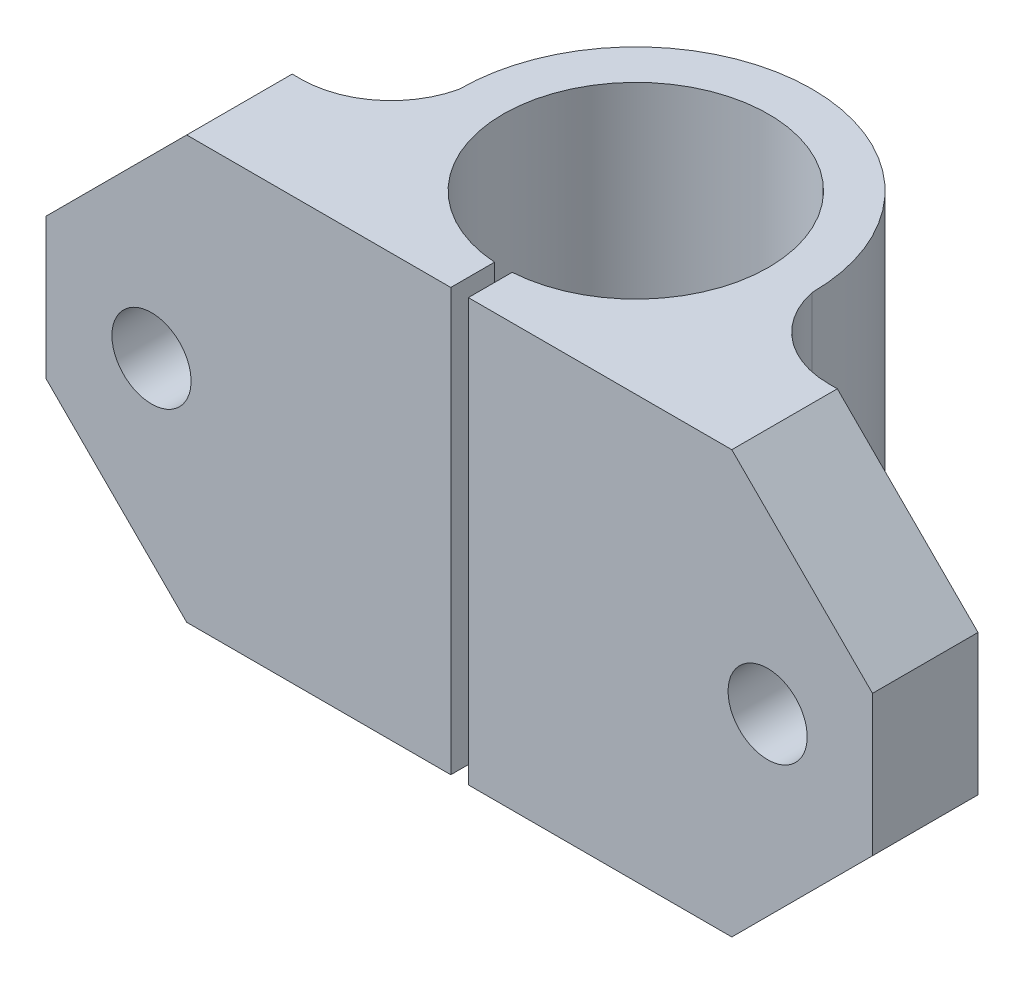
ISO-10303-21;
HEADER;
FILE_DESCRIPTION(('STEP AP214'),'2;1');
FILE_NAME('part.step','',(''),(''),'','','');
FILE_SCHEMA(('AUTOMOTIVE_DESIGN { 1 0 10303 214 1 1 1 1 }'));
ENDSEC;
DATA;
#1=APPLICATION_CONTEXT('core data for automotive mechanical design processes');
#2=APPLICATION_PROTOCOL_DEFINITION('international standard','automotive_design',2000,#1);
#3=PRODUCT_CONTEXT('',#1,'mechanical');
#4=PRODUCT('Part','Part','',(#3));
#5=PRODUCT_RELATED_PRODUCT_CATEGORY('part','',(#4));
#6=PRODUCT_DEFINITION_FORMATION('','',#4);
#7=PRODUCT_DEFINITION_CONTEXT('part definition',#1,'design');
#8=PRODUCT_DEFINITION('design','',#6,#7);
#9=PRODUCT_DEFINITION_SHAPE('','',#8);
#10=(LENGTH_UNIT() NAMED_UNIT(*) SI_UNIT(.MILLI.,.METRE.));
#11=(NAMED_UNIT(*) PLANE_ANGLE_UNIT() SI_UNIT($,.RADIAN.));
#12=(NAMED_UNIT(*) SI_UNIT($,.STERADIAN.) SOLID_ANGLE_UNIT());
#13=UNCERTAINTY_MEASURE_WITH_UNIT(LENGTH_MEASURE(1.E-05),#10,'distance_accuracy_value','');
#14=(GEOMETRIC_REPRESENTATION_CONTEXT(3) GLOBAL_UNCERTAINTY_ASSIGNED_CONTEXT((#13)) GLOBAL_UNIT_ASSIGNED_CONTEXT((#10,
#11,#12)) REPRESENTATION_CONTEXT('',''));
#15=CARTESIAN_POINT('',(0.,0.,0.));
#16=DIRECTION('',(0.,0.,1.));
#17=DIRECTION('',(1.,0.,0.));
#18=AXIS2_PLACEMENT_3D('',#15,#16,#17);
#19=CARTESIAN_POINT('',(0.,0.,0.));
#20=DIRECTION('',(0.,0.,1.));
#21=DIRECTION('',(1.,0.,0.));
#22=AXIS2_PLACEMENT_3D('',#19,#20,#21);
#23=PLANE('',#22);
#24=CARTESIAN_POINT('',(41.0372666212457,12.,0.));
#25=DIRECTION('',(0.,0.,-1.));
#26=DIRECTION('',(-1.,0.,0.));
#27=AXIS2_PLACEMENT_3D('',#24,#25,#26);
#28=CIRCLE('',#27,2.25000000000006);
#29=CARTESIAN_POINT('',(38.7872666212456,12.,0.));
#30=VERTEX_POINT('',#29);
#31=EDGE_CURVE('E348',#30,#30,#28,.T.);
#32=ORIENTED_EDGE('',*,*,#31,.T.);
#33=EDGE_LOOP('',(#32));
#34=FACE_BOUND('',#33,.T.);
#35=DIRECTION('',(1.,0.,0.));
#36=VECTOR('',#35,1.);
#37=CARTESIAN_POINT('',(0.,0.,0.));
#38=LINE('',#37,#36);
#39=CARTESIAN_POINT('',(24.0186333106229,0.,0.));
#40=VERTEX_POINT('',#39);
#41=CARTESIAN_POINT('',(38.9999999999999,0.,0.));
#42=VERTEX_POINT('',#41);
#43=EDGE_CURVE('E192',#40,#42,#38,.T.);
#44=ORIENTED_EDGE('',*,*,#43,.T.);
#45=DIRECTION('',(-0.707106781186549,-0.707106781186546,0.));
#46=VECTOR('',#45,1.);
#47=CARTESIAN_POINT('',(19.4999999999999,-19.5,0.));
#48=LINE('',#47,#46);
#49=CARTESIAN_POINT('',(47.,8.,0.));
#50=VERTEX_POINT('',#49);
#51=EDGE_CURVE('E267',#42,#50,#48,.F.);
#52=ORIENTED_EDGE('',*,*,#51,.T.);
#53=DIRECTION('',(0.,1.,0.));
#54=VECTOR('',#53,1.);
#55=CARTESIAN_POINT('',(47.,0.,0.));
#56=LINE('',#55,#54);
#57=CARTESIAN_POINT('',(47.,16.,0.));
#58=VERTEX_POINT('',#57);
#59=EDGE_CURVE('E238',#50,#58,#56,.T.);
#60=ORIENTED_EDGE('',*,*,#59,.T.);
#61=DIRECTION('',(-0.707106781186546,0.707106781186549,0.));
#62=VECTOR('',#61,1.);
#63=CARTESIAN_POINT('',(31.5000000000001,31.4999999999999,0.));
#64=LINE('',#63,#62);
#65=CARTESIAN_POINT('',(39.,24.,0.));
#66=VERTEX_POINT('',#65);
#67=EDGE_CURVE('E49',#58,#66,#64,.T.);
#68=ORIENTED_EDGE('',*,*,#67,.T.);
#69=DIRECTION('',(1.,0.,0.));
#70=VECTOR('',#69,1.);
#71=CARTESIAN_POINT('',(0.,24.,0.));
#72=LINE('',#71,#70);
#73=CARTESIAN_POINT('',(24.0186333106229,24.,0.));
#74=VERTEX_POINT('',#73);
#75=EDGE_CURVE('E159',#74,#66,#72,.T.);
#76=ORIENTED_EDGE('',*,*,#75,.F.);
#77=DIRECTION('',(0.,-1.,0.));
#78=VECTOR('',#77,1.);
#79=CARTESIAN_POINT('',(24.0186333106229,24.,0.));
#80=LINE('',#79,#78);
#81=EDGE_CURVE('E174',#74,#40,#80,.T.);
#82=ORIENTED_EDGE('',*,*,#81,.T.);
#83=EDGE_LOOP('',(#44,#52,#60,#68,#76,#82));
#84=FACE_BOUND('',#83,.T.);
#85=ADVANCED_FACE('F34',(#34,#84),#23,.T.);
#86=CARTESIAN_POINT('',(0.,0.,-6.));
#87=DIRECTION('',(-1.,0.,0.));
#88=DIRECTION('',(0.,0.,1.));
#89=AXIS2_PLACEMENT_3D('',#86,#87,#88);
#90=PLANE('',#89);
#91=DIRECTION('',(0.,1.,0.));
#92=VECTOR('',#91,1.);
#93=CARTESIAN_POINT('',(0.,0.,-6.));
#94=LINE('',#93,#92);
#95=CARTESIAN_POINT('',(0.,8.,-6.));
#96=VERTEX_POINT('',#95);
#97=CARTESIAN_POINT('',(0.,16.,-6.));
#98=VERTEX_POINT('',#97);
#99=EDGE_CURVE('E222',#96,#98,#94,.T.);
#100=ORIENTED_EDGE('',*,*,#99,.F.);
#101=DIRECTION('',(0.,0.,1.));
#102=VECTOR('',#101,1.);
#103=CARTESIAN_POINT('',(0.,8.,-6.));
#104=LINE('',#103,#102);
#105=CARTESIAN_POINT('',(0.,8.,0.));
#106=VERTEX_POINT('',#105);
#107=EDGE_CURVE('E243',#96,#106,#104,.T.);
#108=ORIENTED_EDGE('',*,*,#107,.T.);
#109=DIRECTION('',(0.,1.,0.));
#110=VECTOR('',#109,1.);
#111=CARTESIAN_POINT('',(0.,0.,0.));
#112=LINE('',#111,#110);
#113=CARTESIAN_POINT('',(0.,16.,0.));
#114=VERTEX_POINT('',#113);
#115=EDGE_CURVE('E206',#106,#114,#112,.T.);
#116=ORIENTED_EDGE('',*,*,#115,.T.);
#117=DIRECTION('',(0.,0.,-1.));
#118=VECTOR('',#117,1.);
#119=CARTESIAN_POINT('',(0.,16.,-6.));
#120=LINE('',#119,#118);
#121=EDGE_CURVE('E225',#114,#98,#120,.T.);
#122=ORIENTED_EDGE('',*,*,#121,.T.);
#123=EDGE_LOOP('',(#100,#108,#116,#122));
#124=FACE_BOUND('',#123,.T.);
#125=ADVANCED_FACE('F303',(#124),#90,.T.);
#126=CARTESIAN_POINT('',(8.50000000000001,0.,-6.));
#127=DIRECTION('',(0.,0.,-1.));
#128=DIRECTION('',(-1.,0.,0.));
#129=AXIS2_PLACEMENT_3D('',#126,#127,#128);
#130=PLANE('',#129);
#131=CARTESIAN_POINT('',(6.,12.,-6.00000000000001));
#132=DIRECTION('',(0.,0.,-1.));
#133=DIRECTION('',(-1.,0.,0.));
#134=AXIS2_PLACEMENT_3D('',#131,#132,#133);
#135=CIRCLE('',#134,2.25000000000007);
#136=CARTESIAN_POINT('',(3.74999999999994,12.,-6.00000000000001));
#137=VERTEX_POINT('',#136);
#138=EDGE_CURVE('E345',#137,#137,#135,.T.);
#139=ORIENTED_EDGE('',*,*,#138,.F.);
#140=EDGE_LOOP('',(#139));
#141=FACE_BOUND('',#140,.T.);
#142=DIRECTION('',(-1.,0.,0.));
#143=VECTOR('',#142,1.);
#144=CARTESIAN_POINT('',(8.50000000000001,0.,-6.));
#145=LINE('',#144,#143);
#146=CARTESIAN_POINT('',(8.50000000000001,0.,-6.00000000000002));
#147=VERTEX_POINT('',#146);
#148=CARTESIAN_POINT('',(8.00000000000003,0.,-6.));
#149=VERTEX_POINT('',#148);
#150=EDGE_CURVE('E203',#147,#149,#145,.T.);
#151=ORIENTED_EDGE('',*,*,#150,.T.);
#152=DIRECTION('',(0.707106781186549,-0.707106781186546,0.));
#153=VECTOR('',#152,1.);
#154=CARTESIAN_POINT('',(8.25000000000002,-0.249999999999996,-6.));
#155=LINE('',#154,#153);
#156=EDGE_CURVE('E256',#149,#96,#155,.F.);
#157=ORIENTED_EDGE('',*,*,#156,.T.);
#158=ORIENTED_EDGE('',*,*,#99,.T.);
#159=DIRECTION('',(0.707106781186546,0.707106781186549,0.));
#160=VECTOR('',#159,1.);
#161=CARTESIAN_POINT('',(-3.75,12.25,-6.));
#162=LINE('',#161,#160);
#163=CARTESIAN_POINT('',(8.,24.,-6.));
#164=VERTEX_POINT('',#163);
#165=EDGE_CURVE('E254',#98,#164,#162,.T.);
#166=ORIENTED_EDGE('',*,*,#165,.T.);
#167=DIRECTION('',(-1.,0.,0.));
#168=VECTOR('',#167,1.);
#169=CARTESIAN_POINT('',(8.50000000000001,24.,-6.));
#170=LINE('',#169,#168);
#171=CARTESIAN_POINT('',(8.50000000000001,24.,-6.00000000000002));
#172=VERTEX_POINT('',#171);
#173=EDGE_CURVE('E220',#172,#164,#170,.T.);
#174=ORIENTED_EDGE('',*,*,#173,.F.);
#175=DIRECTION('',(0.,1.,0.));
#176=VECTOR('',#175,1.);
#177=CARTESIAN_POINT('',(8.50000000000001,0.,-6.00000000000002));
#178=LINE('',#177,#176);
#179=EDGE_CURVE('E226',#147,#172,#178,.T.);
#180=ORIENTED_EDGE('',*,*,#179,.F.);
#181=EDGE_LOOP('',(#151,#157,#158,#166,#174,#180));
#182=FACE_BOUND('',#181,.T.);
#183=ADVANCED_FACE('F289',(#141,#182),#130,.T.);
#184=CARTESIAN_POINT('',(8.50000000000001,0.,-11.1210427356607));
#185=DIRECTION('',(0.,1.,0.));
#186=DIRECTION('',(0.,0.,1.));
#187=AXIS2_PLACEMENT_3D('',#184,#185,#186);
#188=CYLINDRICAL_SURFACE('',#187,5.12104273566066);
#189=CARTESIAN_POINT('',(8.50000000000001,24.,-11.1210427356607));
#190=DIRECTION('',(0.,-1.,0.));
#191=DIRECTION('',(0.,0.,-1.));
#192=AXIS2_PLACEMENT_3D('',#189,#190,#191);
#193=CIRCLE('',#192,5.12104273566066);
#194=CARTESIAN_POINT('',(13.4959473897421,24.,-9.99605901160399));
#195=VERTEX_POINT('',#194);
#196=EDGE_CURVE('E217',#195,#172,#193,.T.);
#197=ORIENTED_EDGE('',*,*,#196,.F.);
#198=DIRECTION('',(0.,1.,0.));
#199=VECTOR('',#198,1.);
#200=CARTESIAN_POINT('',(13.4959473897421,0.,-9.99605901160399));
#201=LINE('',#200,#199);
#202=CARTESIAN_POINT('',(13.4959473897421,0.,-9.99605901160399));
#203=VERTEX_POINT('',#202);
#204=EDGE_CURVE('E228',#203,#195,#201,.T.);
#205=ORIENTED_EDGE('',*,*,#204,.F.);
#206=CARTESIAN_POINT('',(8.50000000000001,0.,-11.1210427356607));
#207=DIRECTION('',(0.,-1.,0.));
#208=DIRECTION('',(0.,0.,-1.));
#209=AXIS2_PLACEMENT_3D('',#206,#207,#208);
#210=CIRCLE('',#209,5.12104273566066);
#211=EDGE_CURVE('E200',#203,#147,#210,.T.);
#212=ORIENTED_EDGE('',*,*,#211,.T.);
#213=ORIENTED_EDGE('',*,*,#179,.T.);
#214=EDGE_LOOP('',(#197,#205,#212,#213));
#215=FACE_BOUND('',#214,.T.);
#216=ADVANCED_FACE('F286',(#215),#188,.F.);
#217=CARTESIAN_POINT('',(23.5186333106229,0.,-10.0227213844719));
#218=DIRECTION('',(0.,1.,0.));
#219=DIRECTION('',(0.,0.,1.));
#220=AXIS2_PLACEMENT_3D('',#217,#218,#219);
#221=CYLINDRICAL_SURFACE('',#220,10.0227213844719);
#222=CARTESIAN_POINT('',(23.5186333106229,24.,-10.0227213844719));
#223=DIRECTION('',(0.,1.,0.));
#224=DIRECTION('',(0.,0.,1.));
#225=AXIS2_PLACEMENT_3D('',#222,#223,#224);
#226=CIRCLE('',#225,10.0227213844719);
#227=CARTESIAN_POINT('',(33.5413546555968,24.,-10.021831577252));
#228=VERTEX_POINT('',#227);
#229=EDGE_CURVE('E214',#228,#195,#226,.T.);
#230=ORIENTED_EDGE('',*,*,#229,.F.);
#231=DIRECTION('',(0.,1.,0.));
#232=VECTOR('',#231,1.);
#233=CARTESIAN_POINT('',(33.5413546555968,0.,-10.021831577252));
#234=LINE('',#233,#232);
#235=CARTESIAN_POINT('',(33.5413546555968,0.,-10.021831577252));
#236=VERTEX_POINT('',#235);
#237=EDGE_CURVE('E230',#236,#228,#234,.T.);
#238=ORIENTED_EDGE('',*,*,#237,.F.);
#239=CARTESIAN_POINT('',(23.5186333106229,0.,-10.0227213844719));
#240=DIRECTION('',(0.,1.,0.));
#241=DIRECTION('',(0.,0.,1.));
#242=AXIS2_PLACEMENT_3D('',#239,#240,#241);
#243=CIRCLE('',#242,10.0227213844719);
#244=EDGE_CURVE('E197',#236,#203,#243,.T.);
#245=ORIENTED_EDGE('',*,*,#244,.T.);
#246=ORIENTED_EDGE('',*,*,#204,.T.);
#247=EDGE_LOOP('',(#230,#238,#245,#246));
#248=FACE_BOUND('',#247,.T.);
#249=ADVANCED_FACE('F282',(#248),#221,.T.);
#250=CARTESIAN_POINT('',(38.5000000000001,0.,-11.0677523541657));
#251=DIRECTION('',(0.,1.,0.));
#252=DIRECTION('',(0.,0.,1.));
#253=AXIS2_PLACEMENT_3D('',#250,#251,#252);
#254=CYLINDRICAL_SURFACE('',#253,5.06775235416579);
#255=CARTESIAN_POINT('',(38.5000000000001,24.,-11.0677523541657));
#256=DIRECTION('',(0.,-1.,0.));
#257=DIRECTION('',(0.,0.,-1.));
#258=AXIS2_PLACEMENT_3D('',#255,#256,#257);
#259=CIRCLE('',#258,5.06775235416579);
#260=CARTESIAN_POINT('',(38.5,24.,-6.00000000000001));
#261=VERTEX_POINT('',#260);
#262=EDGE_CURVE('E211',#261,#228,#259,.T.);
#263=ORIENTED_EDGE('',*,*,#262,.F.);
#264=DIRECTION('',(0.,1.,0.));
#265=VECTOR('',#264,1.);
#266=CARTESIAN_POINT('',(38.5,0.,-6.00000000000001));
#267=LINE('',#266,#265);
#268=CARTESIAN_POINT('',(38.5,0.,-6.00000000000001));
#269=VERTEX_POINT('',#268);
#270=EDGE_CURVE('E232',#269,#261,#267,.T.);
#271=ORIENTED_EDGE('',*,*,#270,.F.);
#272=CARTESIAN_POINT('',(38.5000000000001,0.,-11.0677523541657));
#273=DIRECTION('',(0.,-1.,0.));
#274=DIRECTION('',(0.,0.,-1.));
#275=AXIS2_PLACEMENT_3D('',#272,#273,#274);
#276=CIRCLE('',#275,5.06775235416579);
#277=EDGE_CURVE('E194',#269,#236,#276,.T.);
#278=ORIENTED_EDGE('',*,*,#277,.T.);
#279=ORIENTED_EDGE('',*,*,#237,.T.);
#280=EDGE_LOOP('',(#263,#271,#278,#279));
#281=FACE_BOUND('',#280,.T.);
#282=ADVANCED_FACE('F277',(#281),#254,.F.);
#283=CARTESIAN_POINT('',(47.,0.,-6.));
#284=DIRECTION('',(0.,0.,-1.));
#285=DIRECTION('',(-1.,0.,0.));
#286=AXIS2_PLACEMENT_3D('',#283,#284,#285);
#287=PLANE('',#286);
#288=CARTESIAN_POINT('',(41.0372666212457,12.,-6.00000000000001));
#289=DIRECTION('',(0.,0.,-1.));
#290=DIRECTION('',(-1.,0.,0.));
#291=AXIS2_PLACEMENT_3D('',#288,#289,#290);
#292=CIRCLE('',#291,2.25000000000006);
#293=CARTESIAN_POINT('',(38.7872666212456,12.,-6.00000000000001));
#294=VERTEX_POINT('',#293);
#295=EDGE_CURVE('E352',#294,#294,#292,.T.);
#296=ORIENTED_EDGE('',*,*,#295,.F.);
#297=EDGE_LOOP('',(#296));
#298=FACE_BOUND('',#297,.T.);
#299=DIRECTION('',(0.,1.,0.));
#300=VECTOR('',#299,1.);
#301=CARTESIAN_POINT('',(47.,0.,-6.));
#302=LINE('',#301,#300);
#303=CARTESIAN_POINT('',(47.,8.,-6.));
#304=VERTEX_POINT('',#303);
#305=CARTESIAN_POINT('',(47.,16.,-6.));
#306=VERTEX_POINT('',#305);
#307=EDGE_CURVE('E235',#304,#306,#302,.T.);
#308=ORIENTED_EDGE('',*,*,#307,.F.);
#309=DIRECTION('',(0.707106781186549,0.707106781186546,0.));
#310=VECTOR('',#309,1.);
#311=CARTESIAN_POINT('',(43.,4.00000000000001,-6.));
#312=LINE('',#311,#310);
#313=CARTESIAN_POINT('',(38.9999999999999,0.,-6.00000000000001));
#314=VERTEX_POINT('',#313);
#315=EDGE_CURVE('E264',#304,#314,#312,.F.);
#316=ORIENTED_EDGE('',*,*,#315,.T.);
#317=DIRECTION('',(-1.,0.,0.));
#318=VECTOR('',#317,1.);
#319=CARTESIAN_POINT('',(47.,0.,-6.));
#320=LINE('',#319,#318);
#321=EDGE_CURVE('E191',#314,#269,#320,.T.);
#322=ORIENTED_EDGE('',*,*,#321,.T.);
#323=ORIENTED_EDGE('',*,*,#270,.T.);
#324=DIRECTION('',(-1.,0.,0.));
#325=VECTOR('',#324,1.);
#326=CARTESIAN_POINT('',(47.,24.,-6.));
#327=LINE('',#326,#325);
#328=CARTESIAN_POINT('',(39.,24.,-6.00000000000001));
#329=VERTEX_POINT('',#328);
#330=EDGE_CURVE('E209',#329,#261,#327,.T.);
#331=ORIENTED_EDGE('',*,*,#330,.F.);
#332=DIRECTION('',(0.707106781186546,-0.707106781186549,0.));
#333=VECTOR('',#332,1.);
#334=CARTESIAN_POINT('',(55.,7.99999999999996,-6.));
#335=LINE('',#334,#333);
#336=EDGE_CURVE('E57',#329,#306,#335,.T.);
#337=ORIENTED_EDGE('',*,*,#336,.T.);
#338=EDGE_LOOP('',(#308,#316,#322,#323,#331,#337));
#339=FACE_BOUND('',#338,.T.);
#340=ADVANCED_FACE('F271',(#298,#339),#287,.T.);
#341=CARTESIAN_POINT('',(47.,0.,0.));
#342=DIRECTION('',(1.,0.,0.));
#343=DIRECTION('',(0.,0.,-1.));
#344=AXIS2_PLACEMENT_3D('',#341,#342,#343);
#345=PLANE('',#344);
#346=ORIENTED_EDGE('',*,*,#59,.F.);
#347=DIRECTION('',(0.,0.,-1.));
#348=VECTOR('',#347,1.);
#349=CARTESIAN_POINT('',(47.,8.,0.));
#350=LINE('',#349,#348);
#351=EDGE_CURVE('E260',#50,#304,#350,.T.);
#352=ORIENTED_EDGE('',*,*,#351,.T.);
#353=ORIENTED_EDGE('',*,*,#307,.T.);
#354=DIRECTION('',(0.,0.,1.));
#355=VECTOR('',#354,1.);
#356=CARTESIAN_POINT('',(47.,16.,0.));
#357=LINE('',#356,#355);
#358=EDGE_CURVE('E258',#306,#58,#357,.T.);
#359=ORIENTED_EDGE('',*,*,#358,.T.);
#360=EDGE_LOOP('',(#346,#352,#353,#359));
#361=FACE_BOUND('',#360,.T.);
#362=ADVANCED_FACE('F334',(#361),#345,.T.);
#363=CARTESIAN_POINT('',(6.,12.,0.));
#364=DIRECTION('',(0.,0.,-1.));
#365=DIRECTION('',(-1.,0.,0.));
#366=AXIS2_PLACEMENT_3D('',#363,#364,#365);
#367=CIRCLE('',#366,2.25000000000007);
#368=CARTESIAN_POINT('',(3.74999999999994,12.,0.));
#369=VERTEX_POINT('',#368);
#370=EDGE_CURVE('E170',#369,#369,#367,.T.);
#371=ORIENTED_EDGE('',*,*,#370,.T.);
#372=EDGE_LOOP('',(#371));
#373=FACE_BOUND('',#372,.T.);
#374=ORIENTED_EDGE('',*,*,#115,.F.);
#375=DIRECTION('',(-0.707106781186549,0.707106781186546,0.));
#376=VECTOR('',#375,1.);
#377=CARTESIAN_POINT('',(4.,4.00000000000001,0.));
#378=LINE('',#377,#376);
#379=CARTESIAN_POINT('',(8.00000000000002,0.,0.));
#380=VERTEX_POINT('',#379);
#381=EDGE_CURVE('E248',#106,#380,#378,.F.);
#382=ORIENTED_EDGE('',*,*,#381,.T.);
#383=CARTESIAN_POINT('',(23.0186333106229,0.,0.));
#384=VERTEX_POINT('',#383);
#385=EDGE_CURVE('E189',#380,#384,#38,.T.);
#386=ORIENTED_EDGE('',*,*,#385,.T.);
#387=DIRECTION('',(0.,-1.,0.));
#388=VECTOR('',#387,1.);
#389=CARTESIAN_POINT('',(23.0186333106229,24.,0.));
#390=LINE('',#389,#388);
#391=CARTESIAN_POINT('',(23.0186333106229,24.,0.));
#392=VERTEX_POINT('',#391);
#393=EDGE_CURVE('E185',#392,#384,#390,.T.);
#394=ORIENTED_EDGE('',*,*,#393,.F.);
#395=CARTESIAN_POINT('',(8.,24.,0.));
#396=VERTEX_POINT('',#395);
#397=EDGE_CURVE('E207',#396,#392,#72,.T.);
#398=ORIENTED_EDGE('',*,*,#397,.F.);
#399=DIRECTION('',(-0.707106781186546,-0.707106781186549,0.));
#400=VECTOR('',#399,1.);
#401=CARTESIAN_POINT('',(-7.99999999999999,7.99999999999996,0.));
#402=LINE('',#401,#400);
#403=EDGE_CURVE('E246',#396,#114,#402,.T.);
#404=ORIENTED_EDGE('',*,*,#403,.T.);
#405=EDGE_LOOP('',(#374,#382,#386,#394,#398,#404));
#406=FACE_BOUND('',#405,.T.);
#407=ADVANCED_FACE('F299',(#373,#406),#23,.T.);
#408=CARTESIAN_POINT('',(38.5000000000001,0.,-11.0677523541657));
#409=DIRECTION('',(0.,-1.,0.));
#410=DIRECTION('',(0.,0.,-1.));
#411=AXIS2_PLACEMENT_3D('',#408,#409,#410);
#412=PLANE('',#411);
#413=ORIENTED_EDGE('',*,*,#385,.F.);
#414=DIRECTION('',(0.,0.,-1.));
#415=VECTOR('',#414,1.);
#416=CARTESIAN_POINT('',(8.00000000000003,0.,-11.0677523541657));
#417=LINE('',#416,#415);
#418=EDGE_CURVE('E252',#380,#149,#417,.T.);
#419=ORIENTED_EDGE('',*,*,#418,.T.);
#420=ORIENTED_EDGE('',*,*,#150,.F.);
#421=ORIENTED_EDGE('',*,*,#211,.F.);
#422=ORIENTED_EDGE('',*,*,#244,.F.);
#423=ORIENTED_EDGE('',*,*,#277,.F.);
#424=ORIENTED_EDGE('',*,*,#321,.F.);
#425=DIRECTION('',(0.,0.,1.));
#426=VECTOR('',#425,1.);
#427=CARTESIAN_POINT('',(38.9999999999999,0.,-11.0677523541657));
#428=LINE('',#427,#426);
#429=EDGE_CURVE('E250',#314,#42,#428,.T.);
#430=ORIENTED_EDGE('',*,*,#429,.T.);
#431=ORIENTED_EDGE('',*,*,#43,.F.);
#432=DIRECTION('',(0.,0.,1.));
#433=VECTOR('',#432,1.);
#434=CARTESIAN_POINT('',(24.0186333106229,0.,-2.48929586881175));
#435=LINE('',#434,#433);
#436=CARTESIAN_POINT('',(24.0186333106229,0.,-2.48929586881175));
#437=VERTEX_POINT('',#436);
#438=EDGE_CURVE('E179',#437,#40,#435,.T.);
#439=ORIENTED_EDGE('',*,*,#438,.F.);
#440=CARTESIAN_POINT('',(23.5186333106229,0.,-10.022721384472));
#441=DIRECTION('',(0.,1.,0.));
#442=DIRECTION('',(0.,0.,1.));
#443=AXIS2_PLACEMENT_3D('',#440,#441,#442);
#444=CIRCLE('',#443,7.55000000000005);
#445=CARTESIAN_POINT('',(23.0186333106229,0.,-2.48929586881175));
#446=VERTEX_POINT('',#445);
#447=EDGE_CURVE('E155',#437,#446,#444,.T.);
#448=ORIENTED_EDGE('',*,*,#447,.T.);
#449=DIRECTION('',(0.,0.,-1.));
#450=VECTOR('',#449,1.);
#451=CARTESIAN_POINT('',(23.0186333106229,0.,0.));
#452=LINE('',#451,#450);
#453=EDGE_CURVE('E175',#384,#446,#452,.T.);
#454=ORIENTED_EDGE('',*,*,#453,.F.);
#455=EDGE_LOOP('',(#413,#419,#420,#421,#422,#423,#424,#430,#431,#439,#448,#454));
#456=FACE_BOUND('',#455,.T.);
#457=ADVANCED_FACE('F311',(#456),#412,.T.);
#458=CARTESIAN_POINT('',(38.5000000000001,24.,-11.0677523541657));
#459=DIRECTION('',(0.,-1.,0.));
#460=DIRECTION('',(0.,0.,-1.));
#461=AXIS2_PLACEMENT_3D('',#458,#459,#460);
#462=PLANE('',#461);
#463=ORIENTED_EDGE('',*,*,#173,.T.);
#464=DIRECTION('',(0.,0.,1.));
#465=VECTOR('',#464,1.);
#466=CARTESIAN_POINT('',(8.,24.,0.));
#467=LINE('',#466,#465);
#468=EDGE_CURVE('E11',#164,#396,#467,.T.);
#469=ORIENTED_EDGE('',*,*,#468,.T.);
#470=ORIENTED_EDGE('',*,*,#397,.T.);
#471=DIRECTION('',(0.,0.,-1.));
#472=VECTOR('',#471,1.);
#473=CARTESIAN_POINT('',(23.0186333106229,24.,0.));
#474=LINE('',#473,#472);
#475=CARTESIAN_POINT('',(23.0186333106229,24.,-2.48929586881175));
#476=VERTEX_POINT('',#475);
#477=EDGE_CURVE('E169',#392,#476,#474,.T.);
#478=ORIENTED_EDGE('',*,*,#477,.T.);
#479=CARTESIAN_POINT('',(23.5186333106229,24.,-10.022721384472));
#480=DIRECTION('',(0.,1.,0.));
#481=DIRECTION('',(0.,0.,1.));
#482=AXIS2_PLACEMENT_3D('',#479,#480,#481);
#483=CIRCLE('',#482,7.55000000000005);
#484=CARTESIAN_POINT('',(24.0186333106229,24.,-2.48929586881175));
#485=VERTEX_POINT('',#484);
#486=EDGE_CURVE('E152',#485,#476,#483,.T.);
#487=ORIENTED_EDGE('',*,*,#486,.F.);
#488=DIRECTION('',(0.,0.,1.));
#489=VECTOR('',#488,1.);
#490=CARTESIAN_POINT('',(24.0186333106229,24.,-2.48929586881175));
#491=LINE('',#490,#489);
#492=EDGE_CURVE('E167',#485,#74,#491,.T.);
#493=ORIENTED_EDGE('',*,*,#492,.T.);
#494=ORIENTED_EDGE('',*,*,#75,.T.);
#495=DIRECTION('',(0.,0.,-1.));
#496=VECTOR('',#495,1.);
#497=CARTESIAN_POINT('',(39.,24.,-6.));
#498=LINE('',#497,#496);
#499=EDGE_CURVE('E42',#66,#329,#498,.T.);
#500=ORIENTED_EDGE('',*,*,#499,.T.);
#501=ORIENTED_EDGE('',*,*,#330,.T.);
#502=ORIENTED_EDGE('',*,*,#262,.T.);
#503=ORIENTED_EDGE('',*,*,#229,.T.);
#504=ORIENTED_EDGE('',*,*,#196,.T.);
#505=EDGE_LOOP('',(#463,#469,#470,#478,#487,#493,#494,#500,#501,#502,#503,#504));
#506=FACE_BOUND('',#505,.T.);
#507=ADVANCED_FACE('F166',(#506),#462,.F.);
#508=CARTESIAN_POINT('',(24.0186333106229,24.,-2.48929586881175));
#509=DIRECTION('',(1.,0.,0.));
#510=DIRECTION('',(0.,0.,-1.));
#511=AXIS2_PLACEMENT_3D('',#508,#509,#510);
#512=PLANE('',#511);
#513=ORIENTED_EDGE('',*,*,#438,.T.);
#514=ORIENTED_EDGE('',*,*,#81,.F.);
#515=ORIENTED_EDGE('',*,*,#492,.F.);
#516=DIRECTION('',(0.,-1.,0.));
#517=VECTOR('',#516,1.);
#518=CARTESIAN_POINT('',(24.0186333106229,24.,-2.48929586881175));
#519=LINE('',#518,#517);
#520=EDGE_CURVE('E149',#485,#437,#519,.T.);
#521=ORIENTED_EDGE('',*,*,#520,.T.);
#522=EDGE_LOOP('',(#513,#514,#515,#521));
#523=FACE_BOUND('',#522,.T.);
#524=ADVANCED_FACE('F172',(#523),#512,.F.);
#525=CARTESIAN_POINT('',(23.0186333106229,24.,0.));
#526=DIRECTION('',(-1.,0.,0.));
#527=DIRECTION('',(0.,0.,1.));
#528=AXIS2_PLACEMENT_3D('',#525,#526,#527);
#529=PLANE('',#528);
#530=ORIENTED_EDGE('',*,*,#453,.T.);
#531=DIRECTION('',(0.,-1.,0.));
#532=VECTOR('',#531,1.);
#533=CARTESIAN_POINT('',(23.0186333106229,24.,-2.48929586881175));
#534=LINE('',#533,#532);
#535=EDGE_CURVE('E160',#476,#446,#534,.T.);
#536=ORIENTED_EDGE('',*,*,#535,.F.);
#537=ORIENTED_EDGE('',*,*,#477,.F.);
#538=ORIENTED_EDGE('',*,*,#393,.T.);
#539=EDGE_LOOP('',(#530,#536,#537,#538));
#540=FACE_BOUND('',#539,.T.);
#541=ADVANCED_FACE('F313',(#540),#529,.F.);
#542=CARTESIAN_POINT('',(23.5186333106229,0.,-10.022721384472));
#543=DIRECTION('',(0.,1.,0.));
#544=DIRECTION('',(0.,0.,1.));
#545=AXIS2_PLACEMENT_3D('',#542,#543,#544);
#546=CYLINDRICAL_SURFACE('',#545,7.55000000000005);
#547=ORIENTED_EDGE('',*,*,#486,.T.);
#548=ORIENTED_EDGE('',*,*,#535,.T.);
#549=ORIENTED_EDGE('',*,*,#447,.F.);
#550=ORIENTED_EDGE('',*,*,#520,.F.);
#551=EDGE_LOOP('',(#547,#548,#549,#550));
#552=FACE_BOUND('',#551,.T.);
#553=ADVANCED_FACE('F151',(#552),#546,.F.);
#554=CARTESIAN_POINT('',(6.,12.,-6.00000000000001));
#555=DIRECTION('',(0.,0.,-1.));
#556=DIRECTION('',(-1.,0.,0.));
#557=AXIS2_PLACEMENT_3D('',#554,#555,#556);
#558=CYLINDRICAL_SURFACE('',#557,2.25000000000007);
#559=ORIENTED_EDGE('',*,*,#370,.F.);
#560=EDGE_LOOP('',(#559));
#561=FACE_BOUND('',#560,.T.);
#562=ORIENTED_EDGE('',*,*,#138,.T.);
#563=EDGE_LOOP('',(#562));
#564=FACE_BOUND('',#563,.T.);
#565=ADVANCED_FACE('F320',(#561,#564),#558,.F.);
#566=CARTESIAN_POINT('',(41.0372666212457,12.,-6.00000000000001));
#567=DIRECTION('',(0.,0.,-1.));
#568=DIRECTION('',(-1.,0.,0.));
#569=AXIS2_PLACEMENT_3D('',#566,#567,#568);
#570=CYLINDRICAL_SURFACE('',#569,2.25000000000006);
#571=ORIENTED_EDGE('',*,*,#31,.F.);
#572=EDGE_LOOP('',(#571));
#573=FACE_BOUND('',#572,.T.);
#574=ORIENTED_EDGE('',*,*,#295,.T.);
#575=EDGE_LOOP('',(#574));
#576=FACE_BOUND('',#575,.T.);
#577=ADVANCED_FACE('F356',(#573,#576),#570,.F.);
#578=CARTESIAN_POINT('',(0.,8.,-6.));
#579=DIRECTION('',(0.707106781186546,0.707106781186549,0.));
#580=DIRECTION('',(0.,0.,1.));
#581=AXIS2_PLACEMENT_3D('',#578,#579,#580);
#582=PLANE('',#581);
#583=ORIENTED_EDGE('',*,*,#156,.F.);
#584=ORIENTED_EDGE('',*,*,#418,.F.);
#585=ORIENTED_EDGE('',*,*,#381,.F.);
#586=ORIENTED_EDGE('',*,*,#107,.F.);
#587=EDGE_LOOP('',(#583,#584,#585,#586));
#588=FACE_BOUND('',#587,.T.);
#589=ADVANCED_FACE('F306',(#588),#582,.F.);
#590=CARTESIAN_POINT('',(47.,8.,0.));
#591=DIRECTION('',(-0.707106781186546,0.707106781186549,0.));
#592=DIRECTION('',(0.,0.,-1.));
#593=AXIS2_PLACEMENT_3D('',#590,#591,#592);
#594=PLANE('',#593);
#595=ORIENTED_EDGE('',*,*,#51,.F.);
#596=ORIENTED_EDGE('',*,*,#429,.F.);
#597=ORIENTED_EDGE('',*,*,#315,.F.);
#598=ORIENTED_EDGE('',*,*,#351,.F.);
#599=EDGE_LOOP('',(#595,#596,#597,#598));
#600=FACE_BOUND('',#599,.T.);
#601=ADVANCED_FACE('F384',(#600),#594,.F.);
#602=CARTESIAN_POINT('',(8.,24.,-11.0677523541657));
#603=DIRECTION('',(-0.707106781186549,0.707106781186546,0.));
#604=DIRECTION('',(0.,0.,-1.));
#605=AXIS2_PLACEMENT_3D('',#602,#603,#604);
#606=PLANE('',#605);
#607=ORIENTED_EDGE('',*,*,#165,.F.);
#608=ORIENTED_EDGE('',*,*,#121,.F.);
#609=ORIENTED_EDGE('',*,*,#403,.F.);
#610=ORIENTED_EDGE('',*,*,#468,.F.);
#611=EDGE_LOOP('',(#607,#608,#609,#610));
#612=FACE_BOUND('',#611,.T.);
#613=ADVANCED_FACE('F295',(#612),#606,.T.);
#614=CARTESIAN_POINT('',(39.,24.,-11.0677523541657));
#615=DIRECTION('',(0.707106781186549,0.707106781186546,0.));
#616=DIRECTION('',(0.,0.,1.));
#617=AXIS2_PLACEMENT_3D('',#614,#615,#616);
#618=PLANE('',#617);
#619=ORIENTED_EDGE('',*,*,#67,.F.);
#620=ORIENTED_EDGE('',*,*,#358,.F.);
#621=ORIENTED_EDGE('',*,*,#336,.F.);
#622=ORIENTED_EDGE('',*,*,#499,.F.);
#623=EDGE_LOOP('',(#619,#620,#621,#622));
#624=FACE_BOUND('',#623,.T.);
#625=ADVANCED_FACE('F36',(#624),#618,.T.);
#626=CLOSED_SHELL('',(#85,#125,#183,#216,#249,#282,#340,#362,#407,#457,#507,#524,#541,#553,#565,
#577,#589,#601,#613,#625));
#627=MANIFOLD_SOLID_BREP('B2',#626);
#628=ADVANCED_BREP_SHAPE_REPRESENTATION('',(#18,#627),#14);
#629=SHAPE_DEFINITION_REPRESENTATION(#9,#628);
ENDSEC;
END-ISO-10303-21;
